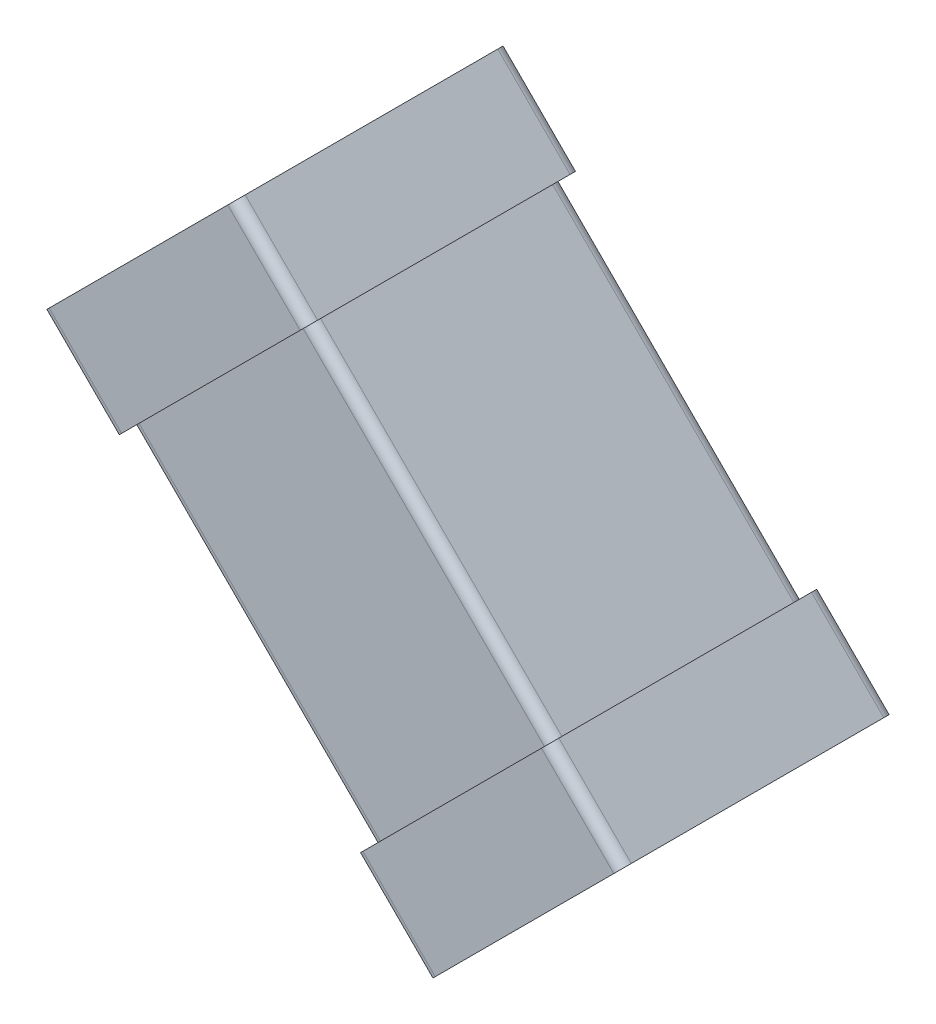
ISO-10303-21;
HEADER;
FILE_DESCRIPTION(('STEP AP214'),'2;1');
FILE_NAME('part.step','',(''),(''),'','','');
FILE_SCHEMA(('AUTOMOTIVE_DESIGN { 1 0 10303 214 1 1 1 1 }'));
ENDSEC;
DATA;
#1=APPLICATION_CONTEXT('core data for automotive mechanical design processes');
#2=APPLICATION_PROTOCOL_DEFINITION('international standard','automotive_design',2000,#1);
#3=PRODUCT_CONTEXT('',#1,'mechanical');
#4=PRODUCT('Part','Part','',(#3));
#5=PRODUCT_RELATED_PRODUCT_CATEGORY('part','',(#4));
#6=PRODUCT_DEFINITION_FORMATION('','',#4);
#7=PRODUCT_DEFINITION_CONTEXT('part definition',#1,'design');
#8=PRODUCT_DEFINITION('design','',#6,#7);
#9=PRODUCT_DEFINITION_SHAPE('','',#8);
#10=(LENGTH_UNIT() NAMED_UNIT(*) SI_UNIT(.MILLI.,.METRE.));
#11=(NAMED_UNIT(*) PLANE_ANGLE_UNIT() SI_UNIT($,.RADIAN.));
#12=(NAMED_UNIT(*) SI_UNIT($,.STERADIAN.) SOLID_ANGLE_UNIT());
#13=UNCERTAINTY_MEASURE_WITH_UNIT(LENGTH_MEASURE(1.E-05),#10,'distance_accuracy_value','');
#14=(GEOMETRIC_REPRESENTATION_CONTEXT(3) GLOBAL_UNCERTAINTY_ASSIGNED_CONTEXT((#13)) GLOBAL_UNIT_ASSIGNED_CONTEXT((#10,
#11,#12)) REPRESENTATION_CONTEXT('',''));
#15=CARTESIAN_POINT('',(0.,0.,0.));
#16=DIRECTION('',(0.,0.,1.));
#17=DIRECTION('',(1.,0.,0.));
#18=AXIS2_PLACEMENT_3D('',#15,#16,#17);
#19=CARTESIAN_POINT('',(174.984206992412,104.541135154926,112.211582908599));
#20=DIRECTION('',(0.707106781186548,-0.707106781186547,0.));
#21=DIRECTION('',(0.,0.,-1.));
#22=AXIS2_PLACEMENT_3D('',#19,#20,#21);
#23=PLANE('',#22);
#24=DIRECTION('',(0.,0.,1.));
#25=VECTOR('',#24,1.);
#26=CARTESIAN_POINT('',(174.984206992412,104.541135154926,112.211582908599));
#27=LINE('',#26,#25);
#28=CARTESIAN_POINT('',(174.984206992412,104.541135154926,112.241582908599));
#29=VERTEX_POINT('',#28);
#30=CARTESIAN_POINT('',(174.984206992412,104.541135154926,112.981582908599));
#31=VERTEX_POINT('',#30);
#32=EDGE_CURVE('E67',#29,#31,#27,.T.);
#33=ORIENTED_EDGE('',*,*,#32,.F.);
#34=CARTESIAN_POINT('',(175.005420195848,104.562348358362,112.241582908599));
#35=DIRECTION('',(0.707106781186548,-0.707106781186547,0.));
#36=DIRECTION('',(0.,0.,1.));
#37=AXIS2_PLACEMENT_3D('',#34,#35,#36);
#38=CIRCLE('',#37,0.0300000000000023);
#39=CARTESIAN_POINT('',(175.005420195848,104.562348358362,112.211582908599));
#40=VERTEX_POINT('',#39);
#41=EDGE_CURVE('E11',#29,#40,#38,.T.);
#42=ORIENTED_EDGE('',*,*,#41,.T.);
#43=DIRECTION('',(0.707106781186547,0.707106781186548,0.));
#44=VECTOR('',#43,1.);
#45=CARTESIAN_POINT('',(174.984206992412,104.541135154926,112.211582908599));
#46=LINE('',#45,#44);
#47=CARTESIAN_POINT('',(175.528679213926,105.08560737644,112.211582908599));
#48=VERTEX_POINT('',#47);
#49=EDGE_CURVE('E55',#40,#48,#46,.T.);
#50=ORIENTED_EDGE('',*,*,#49,.T.);
#51=CARTESIAN_POINT('',(175.528679213926,105.08560737644,112.241582908599));
#52=DIRECTION('',(-0.707106781186548,0.707106781186547,0.));
#53=DIRECTION('',(0.,0.,1.));
#54=AXIS2_PLACEMENT_3D('',#51,#52,#53);
#55=CIRCLE('',#54,0.0300000000000023);
#56=CARTESIAN_POINT('',(175.549892417362,105.106820579876,112.241582908599));
#57=VERTEX_POINT('',#56);
#58=EDGE_CURVE('E294',#57,#48,#55,.T.);
#59=ORIENTED_EDGE('',*,*,#58,.F.);
#60=DIRECTION('',(0.,0.,1.));
#61=VECTOR('',#60,1.);
#62=CARTESIAN_POINT('',(175.549892417362,105.106820579876,112.211582908599));
#63=LINE('',#62,#61);
#64=CARTESIAN_POINT('',(175.549892417362,105.106820579876,112.981582908599));
#65=VERTEX_POINT('',#64);
#66=EDGE_CURVE('E289',#57,#65,#63,.T.);
#67=ORIENTED_EDGE('',*,*,#66,.T.);
#68=CARTESIAN_POINT('',(175.528679213926,105.08560737644,112.981582908599));
#69=DIRECTION('',(0.707106781186548,-0.707106781186547,0.));
#70=DIRECTION('',(0.,0.,1.));
#71=AXIS2_PLACEMENT_3D('',#68,#69,#70);
#72=CIRCLE('',#71,0.0300000000000023);
#73=CARTESIAN_POINT('',(175.528679213926,105.08560737644,113.011582908599));
#74=VERTEX_POINT('',#73);
#75=EDGE_CURVE('E325',#65,#74,#72,.T.);
#76=ORIENTED_EDGE('',*,*,#75,.T.);
#77=DIRECTION('',(0.707106781186547,0.707106781186548,0.));
#78=VECTOR('',#77,1.);
#79=CARTESIAN_POINT('',(174.984206992412,104.541135154926,113.011582908599));
#80=LINE('',#79,#78);
#81=CARTESIAN_POINT('',(175.005420195848,104.562348358362,113.011582908599));
#82=VERTEX_POINT('',#81);
#83=EDGE_CURVE('E298',#82,#74,#80,.T.);
#84=ORIENTED_EDGE('',*,*,#83,.F.);
#85=CARTESIAN_POINT('',(175.005420195848,104.562348358362,112.981582908599));
#86=DIRECTION('',(-0.707106781186548,0.707106781186547,0.));
#87=DIRECTION('',(0.,0.,1.));
#88=AXIS2_PLACEMENT_3D('',#85,#86,#87);
#89=CIRCLE('',#88,0.0300000000000023);
#90=EDGE_CURVE('E343',#31,#82,#89,.T.);
#91=ORIENTED_EDGE('',*,*,#90,.F.);
#92=EDGE_LOOP('',(#33,#42,#50,#59,#67,#76,#84,#91));
#93=FACE_BOUND('',#92,.T.);
#94=ADVANCED_FACE('F44',(#93),#23,.T.);
#95=CARTESIAN_POINT('',(175.337760383006,105.318952614231,112.211582908599));
#96=DIRECTION('',(0.707106781186547,0.707106781186548,0.));
#97=DIRECTION('',(0.,0.,-1.));
#98=AXIS2_PLACEMENT_3D('',#95,#96,#97);
#99=PLANE('',#98);
#100=ORIENTED_EDGE('',*,*,#66,.F.);
#101=DIRECTION('',(0.707106781186548,-0.707106781186547,0.));
#102=VECTOR('',#101,1.);
#103=CARTESIAN_POINT('',(175.337760383006,105.318952614231,112.241582908599));
#104=LINE('',#103,#102);
#105=CARTESIAN_POINT('',(175.337760383006,105.318952614231,112.241582908599));
#106=VERTEX_POINT('',#105);
#107=EDGE_CURVE('E290',#106,#57,#104,.T.);
#108=ORIENTED_EDGE('',*,*,#107,.F.);
#109=DIRECTION('',(0.,0.,1.));
#110=VECTOR('',#109,1.);
#111=CARTESIAN_POINT('',(175.337760383006,105.318952614231,112.211582908599));
#112=LINE('',#111,#110);
#113=CARTESIAN_POINT('',(175.337760383006,105.318952614231,112.981582908599));
#114=VERTEX_POINT('',#113);
#115=EDGE_CURVE('E323',#106,#114,#112,.T.);
#116=ORIENTED_EDGE('',*,*,#115,.T.);
#117=DIRECTION('',(0.707106781186548,-0.707106781186547,0.));
#118=VECTOR('',#117,1.);
#119=CARTESIAN_POINT('',(175.337760383006,105.318952614231,112.981582908599));
#120=LINE('',#119,#118);
#121=EDGE_CURVE('E320',#114,#65,#120,.T.);
#122=ORIENTED_EDGE('',*,*,#121,.T.);
#123=EDGE_LOOP('',(#100,#108,#116,#122));
#124=FACE_BOUND('',#123,.T.);
#125=ADVANCED_FACE('F537',(#124),#99,.T.);
#126=CARTESIAN_POINT('',(175.31654717957,105.297739410796,112.981582908599));
#127=DIRECTION('',(0.707106781186548,-0.707106781186548,0.));
#128=DIRECTION('',(0.707106781186548,0.707106781186548,0.));
#129=AXIS2_PLACEMENT_3D('',#126,#127,#128);
#130=CYLINDRICAL_SURFACE('',#129,0.0299999999999963);
#131=CARTESIAN_POINT('',(175.31654717957,105.297739410796,112.981582908599));
#132=DIRECTION('',(0.707106781186548,-0.707106781186547,0.));
#133=DIRECTION('',(0.,0.,1.));
#134=AXIS2_PLACEMENT_3D('',#131,#132,#133);
#135=CIRCLE('',#134,0.0300000000000023);
#136=CARTESIAN_POINT('',(175.31654717957,105.297739410796,113.011582908599));
#137=VERTEX_POINT('',#136);
#138=EDGE_CURVE('E324',#114,#137,#135,.T.);
#139=ORIENTED_EDGE('',*,*,#138,.T.);
#140=DIRECTION('',(0.707106781186548,-0.707106781186547,0.));
#141=VECTOR('',#140,1.);
#142=CARTESIAN_POINT('',(175.31654717957,105.297739410796,113.011582908599));
#143=LINE('',#142,#141);
#144=EDGE_CURVE('E293',#137,#74,#143,.T.);
#145=ORIENTED_EDGE('',*,*,#144,.T.);
#146=ORIENTED_EDGE('',*,*,#75,.F.);
#147=ORIENTED_EDGE('',*,*,#121,.F.);
#148=EDGE_LOOP('',(#139,#145,#146,#147));
#149=FACE_BOUND('',#148,.T.);
#150=ADVANCED_FACE('F542',(#149),#130,.T.);
#151=CARTESIAN_POINT('',(175.31654717957,105.297739410796,112.241582908599));
#152=DIRECTION('',(0.707106781186548,-0.707106781186548,0.));
#153=DIRECTION('',(0.707106781186548,0.707106781186548,0.));
#154=AXIS2_PLACEMENT_3D('',#151,#152,#153);
#155=CYLINDRICAL_SURFACE('',#154,0.0299999999999963);
#156=ORIENTED_EDGE('',*,*,#107,.T.);
#157=ORIENTED_EDGE('',*,*,#58,.T.);
#158=DIRECTION('',(0.707106781186548,-0.707106781186547,0.));
#159=VECTOR('',#158,1.);
#160=CARTESIAN_POINT('',(175.31654717957,105.297739410796,112.211582908599));
#161=LINE('',#160,#159);
#162=CARTESIAN_POINT('',(175.31654717957,105.297739410796,112.211582908599));
#163=VERTEX_POINT('',#162);
#164=EDGE_CURVE('E306',#163,#48,#161,.T.);
#165=ORIENTED_EDGE('',*,*,#164,.F.);
#166=CARTESIAN_POINT('',(175.31654717957,105.297739410796,112.241582908599));
#167=DIRECTION('',(-0.707106781186548,0.707106781186547,0.));
#168=DIRECTION('',(0.,0.,1.));
#169=AXIS2_PLACEMENT_3D('',#166,#167,#168);
#170=CIRCLE('',#169,0.0300000000000023);
#171=EDGE_CURVE('E48',#106,#163,#170,.T.);
#172=ORIENTED_EDGE('',*,*,#171,.F.);
#173=EDGE_LOOP('',(#156,#157,#165,#172));
#174=FACE_BOUND('',#173,.T.);
#175=ADVANCED_FACE('F566',(#174),#155,.T.);
#176=CARTESIAN_POINT('',(174.772074958056,104.753267189282,113.011582908599));
#177=DIRECTION('',(0.,0.,1.));
#178=DIRECTION('',(1.,0.,0.));
#179=AXIS2_PLACEMENT_3D('',#176,#177,#178);
#180=PLANE('',#179);
#181=DIRECTION('',(0.707106781186547,0.707106781186548,0.));
#182=VECTOR('',#181,1.);
#183=CARTESIAN_POINT('',(174.772074958056,104.753267189282,113.011582908599));
#184=LINE('',#183,#182);
#185=CARTESIAN_POINT('',(174.793288161492,104.774480392718,113.011582908599));
#186=VERTEX_POINT('',#185);
#187=EDGE_CURVE('E478',#186,#137,#184,.T.);
#188=ORIENTED_EDGE('',*,*,#187,.F.);
#189=DIRECTION('',(0.707106781186548,-0.707106781186547,0.));
#190=VECTOR('',#189,1.);
#191=CARTESIAN_POINT('',(174.793288161492,104.774480392718,113.011582908599));
#192=LINE('',#191,#190);
#193=EDGE_CURVE('E295',#186,#82,#192,.T.);
#194=ORIENTED_EDGE('',*,*,#193,.T.);
#195=ORIENTED_EDGE('',*,*,#83,.T.);
#196=ORIENTED_EDGE('',*,*,#144,.F.);
#197=EDGE_LOOP('',(#188,#194,#195,#196));
#198=FACE_BOUND('',#197,.T.);
#199=ADVANCED_FACE('F569',(#198),#180,.T.);
#200=CARTESIAN_POINT('',(174.772074958056,104.753267189282,112.211582908599));
#201=DIRECTION('',(0.,0.,1.));
#202=DIRECTION('',(1.,0.,0.));
#203=AXIS2_PLACEMENT_3D('',#200,#201,#202);
#204=PLANE('',#203);
#205=ORIENTED_EDGE('',*,*,#164,.T.);
#206=ORIENTED_EDGE('',*,*,#49,.F.);
#207=DIRECTION('',(0.707106781186548,-0.707106781186547,0.));
#208=VECTOR('',#207,1.);
#209=CARTESIAN_POINT('',(174.793288161492,104.774480392718,112.211582908599));
#210=LINE('',#209,#208);
#211=CARTESIAN_POINT('',(174.793288161492,104.774480392718,112.211582908599));
#212=VERTEX_POINT('',#211);
#213=EDGE_CURVE('E344',#212,#40,#210,.T.);
#214=ORIENTED_EDGE('',*,*,#213,.F.);
#215=DIRECTION('',(0.707106781186547,0.707106781186548,0.));
#216=VECTOR('',#215,1.);
#217=CARTESIAN_POINT('',(174.772074958056,104.753267189282,112.211582908599));
#218=LINE('',#217,#216);
#219=EDGE_CURVE('E315',#212,#163,#218,.T.);
#220=ORIENTED_EDGE('',*,*,#219,.T.);
#221=EDGE_LOOP('',(#205,#206,#214,#220));
#222=FACE_BOUND('',#221,.T.);
#223=ADVANCED_FACE('F46',(#222),#204,.F.);
#224=CARTESIAN_POINT('',(174.793288161492,104.774480392718,112.981582908599));
#225=DIRECTION('',(0.707106781186548,-0.707106781186548,0.));
#226=DIRECTION('',(-0.707106781186548,-0.707106781186548,0.));
#227=AXIS2_PLACEMENT_3D('',#224,#225,#226);
#228=CYLINDRICAL_SURFACE('',#227,0.0299999999999963);
#229=DIRECTION('',(0.707106781186548,-0.707106781186547,0.));
#230=VECTOR('',#229,1.);
#231=CARTESIAN_POINT('',(174.772074958056,104.753267189282,112.981582908599));
#232=LINE('',#231,#230);
#233=CARTESIAN_POINT('',(174.772074958056,104.753267189282,112.981582908599));
#234=VERTEX_POINT('',#233);
#235=EDGE_CURVE('E389',#234,#31,#232,.T.);
#236=ORIENTED_EDGE('',*,*,#235,.T.);
#237=ORIENTED_EDGE('',*,*,#90,.T.);
#238=ORIENTED_EDGE('',*,*,#193,.F.);
#239=CARTESIAN_POINT('',(174.793288161492,104.774480392718,112.981582908599));
#240=DIRECTION('',(-0.707106781186548,0.707106781186547,0.));
#241=DIRECTION('',(0.,0.,1.));
#242=AXIS2_PLACEMENT_3D('',#239,#240,#241);
#243=CIRCLE('',#242,0.0300000000000023);
#244=EDGE_CURVE('E477',#234,#186,#243,.T.);
#245=ORIENTED_EDGE('',*,*,#244,.F.);
#246=EDGE_LOOP('',(#236,#237,#238,#245));
#247=FACE_BOUND('',#246,.T.);
#248=ADVANCED_FACE('F558',(#247),#228,.T.);
#249=CARTESIAN_POINT('',(174.793288161492,104.774480392718,112.241582908599));
#250=DIRECTION('',(0.707106781186548,-0.707106781186548,0.));
#251=DIRECTION('',(-0.707106781186548,-0.707106781186548,0.));
#252=AXIS2_PLACEMENT_3D('',#249,#250,#251);
#253=CYLINDRICAL_SURFACE('',#252,0.0299999999999963);
#254=CARTESIAN_POINT('',(174.793288161492,104.774480392718,112.241582908599));
#255=DIRECTION('',(0.707106781186548,-0.707106781186547,0.));
#256=DIRECTION('',(0.,0.,1.));
#257=AXIS2_PLACEMENT_3D('',#254,#255,#256);
#258=CIRCLE('',#257,0.0300000000000023);
#259=CARTESIAN_POINT('',(174.772074958056,104.753267189282,112.241582908599));
#260=VERTEX_POINT('',#259);
#261=EDGE_CURVE('E339',#260,#212,#258,.T.);
#262=ORIENTED_EDGE('',*,*,#261,.T.);
#263=ORIENTED_EDGE('',*,*,#213,.T.);
#264=ORIENTED_EDGE('',*,*,#41,.F.);
#265=DIRECTION('',(0.707106781186548,-0.707106781186547,0.));
#266=VECTOR('',#265,1.);
#267=CARTESIAN_POINT('',(174.772074958056,104.753267189282,112.241582908599));
#268=LINE('',#267,#266);
#269=EDGE_CURVE('E444',#260,#29,#268,.T.);
#270=ORIENTED_EDGE('',*,*,#269,.F.);
#271=EDGE_LOOP('',(#262,#263,#264,#270));
#272=FACE_BOUND('',#271,.T.);
#273=ADVANCED_FACE('F547',(#272),#253,.T.);
#274=CARTESIAN_POINT('',(174.772074958056,104.753267189282,112.211582908599));
#275=DIRECTION('',(0.707106781186547,0.707106781186548,0.));
#276=DIRECTION('',(0.,0.,-1.));
#277=AXIS2_PLACEMENT_3D('',#274,#275,#276);
#278=PLANE('',#277);
#279=ORIENTED_EDGE('',*,*,#235,.F.);
#280=DIRECTION('',(0.,0.,1.));
#281=VECTOR('',#280,1.);
#282=CARTESIAN_POINT('',(174.772074958056,104.753267189282,112.211582908599));
#283=LINE('',#282,#281);
#284=EDGE_CURVE('E284',#260,#234,#283,.T.);
#285=ORIENTED_EDGE('',*,*,#284,.F.);
#286=ORIENTED_EDGE('',*,*,#269,.T.);
#287=ORIENTED_EDGE('',*,*,#32,.T.);
#288=EDGE_LOOP('',(#279,#285,#286,#287));
#289=FACE_BOUND('',#288,.T.);
#290=ADVANCED_FACE('F554',(#289),#278,.F.);
#291=CARTESIAN_POINT('',(174.772074958056,104.753267189282,112.211582908599));
#292=DIRECTION('',(0.707106781186548,-0.707106781186547,0.));
#293=DIRECTION('',(0.,0.,-1.));
#294=AXIS2_PLACEMENT_3D('',#291,#292,#293);
#295=PLANE('',#294);
#296=ORIENTED_EDGE('',*,*,#244,.T.);
#297=ORIENTED_EDGE('',*,*,#187,.T.);
#298=ORIENTED_EDGE('',*,*,#138,.F.);
#299=ORIENTED_EDGE('',*,*,#115,.F.);
#300=ORIENTED_EDGE('',*,*,#171,.T.);
#301=ORIENTED_EDGE('',*,*,#219,.F.);
#302=ORIENTED_EDGE('',*,*,#261,.F.);
#303=ORIENTED_EDGE('',*,*,#284,.T.);
#304=EDGE_LOOP('',(#296,#297,#298,#299,#300,#301,#302,#303));
#305=FACE_BOUND('',#304,.T.);
#306=DIRECTION('',(0.707106781186547,0.707106781186548,0.));
#307=VECTOR('',#306,1.);
#308=CARTESIAN_POINT('',(174.793288161492,104.774480392718,112.241582908599));
#309=LINE('',#308,#307);
#310=CARTESIAN_POINT('',(174.814501364928,104.795693596153,112.241582908599));
#311=VERTEX_POINT('',#310);
#312=CARTESIAN_POINT('',(175.295333976134,105.27652620736,112.241582908599));
#313=VERTEX_POINT('',#312);
#314=EDGE_CURVE('E281',#311,#313,#309,.T.);
#315=ORIENTED_EDGE('',*,*,#314,.T.);
#316=CARTESIAN_POINT('',(175.295333976134,105.27652620736,112.271582908599));
#317=DIRECTION('',(-0.707106781186548,0.707106781186547,0.));
#318=DIRECTION('',(0.,0.,1.));
#319=AXIS2_PLACEMENT_3D('',#316,#317,#318);
#320=CIRCLE('',#319,0.0300000000000023);
#321=CARTESIAN_POINT('',(175.31654717957,105.297739410796,112.271582908599));
#322=VERTEX_POINT('',#321);
#323=EDGE_CURVE('E337',#322,#313,#320,.T.);
#324=ORIENTED_EDGE('',*,*,#323,.F.);
#325=DIRECTION('',(0.,0.,1.));
#326=VECTOR('',#325,1.);
#327=CARTESIAN_POINT('',(175.31654717957,105.297739410796,112.241582908599));
#328=LINE('',#327,#326);
#329=CARTESIAN_POINT('',(175.31654717957,105.297739410796,112.951582908599));
#330=VERTEX_POINT('',#329);
#331=EDGE_CURVE('E285',#322,#330,#328,.T.);
#332=ORIENTED_EDGE('',*,*,#331,.T.);
#333=CARTESIAN_POINT('',(175.295333976134,105.27652620736,112.951582908599));
#334=DIRECTION('',(0.707106781186548,-0.707106781186547,0.));
#335=DIRECTION('',(0.,0.,1.));
#336=AXIS2_PLACEMENT_3D('',#333,#334,#335);
#337=CIRCLE('',#336,0.0300000000000023);
#338=CARTESIAN_POINT('',(175.295333976134,105.27652620736,112.981582908599));
#339=VERTEX_POINT('',#338);
#340=EDGE_CURVE('E402',#330,#339,#337,.T.);
#341=ORIENTED_EDGE('',*,*,#340,.T.);
#342=DIRECTION('',(0.707106781186547,0.707106781186548,0.));
#343=VECTOR('',#342,1.);
#344=CARTESIAN_POINT('',(174.793288161492,104.774480392718,112.981582908599));
#345=LINE('',#344,#343);
#346=CARTESIAN_POINT('',(174.814501364928,104.795693596153,112.981582908599));
#347=VERTEX_POINT('',#346);
#348=EDGE_CURVE('E260',#347,#339,#345,.T.);
#349=ORIENTED_EDGE('',*,*,#348,.F.);
#350=CARTESIAN_POINT('',(174.814501364928,104.795693596153,112.951582908599));
#351=DIRECTION('',(-0.707106781186548,0.707106781186547,0.));
#352=DIRECTION('',(0.,0.,1.));
#353=AXIS2_PLACEMENT_3D('',#350,#351,#352);
#354=CIRCLE('',#353,0.0300000000000023);
#355=CARTESIAN_POINT('',(174.793288161492,104.774480392718,112.951582908599));
#356=VERTEX_POINT('',#355);
#357=EDGE_CURVE('E431',#356,#347,#354,.T.);
#358=ORIENTED_EDGE('',*,*,#357,.F.);
#359=DIRECTION('',(0.,0.,1.));
#360=VECTOR('',#359,1.);
#361=CARTESIAN_POINT('',(174.793288161492,104.774480392718,112.241582908599));
#362=LINE('',#361,#360);
#363=CARTESIAN_POINT('',(174.793288161492,104.774480392718,112.271582908599));
#364=VERTEX_POINT('',#363);
#365=EDGE_CURVE('E333',#364,#356,#362,.T.);
#366=ORIENTED_EDGE('',*,*,#365,.F.);
#367=CARTESIAN_POINT('',(174.814501364928,104.795693596153,112.271582908599));
#368=DIRECTION('',(0.707106781186548,-0.707106781186547,0.));
#369=DIRECTION('',(0.,0.,1.));
#370=AXIS2_PLACEMENT_3D('',#367,#368,#369);
#371=CIRCLE('',#370,0.0300000000000023);
#372=EDGE_CURVE('E332',#364,#311,#371,.T.);
#373=ORIENTED_EDGE('',*,*,#372,.T.);
#374=EDGE_LOOP('',(#315,#324,#332,#341,#349,#358,#366,#373));
#375=FACE_BOUND('',#374,.T.);
#376=ADVANCED_FACE('F519',(#305,#375),#295,.F.);
#377=CARTESIAN_POINT('',(174.086181380306,105.481587173904,112.241582908599));
#378=DIRECTION('',(0.707106781186547,0.707106781186548,0.));
#379=DIRECTION('',(0.,0.,-1.));
#380=AXIS2_PLACEMENT_3D('',#377,#378,#379);
#381=PLANE('',#380);
#382=DIRECTION('',(0.707106781186548,-0.707106781186547,0.));
#383=VECTOR('',#382,1.);
#384=CARTESIAN_POINT('',(174.086181380306,105.481587173904,112.951582908599));
#385=LINE('',#384,#383);
#386=CARTESIAN_POINT('',(174.086181380306,105.481587173904,112.951582908599));
#387=VERTEX_POINT('',#386);
#388=EDGE_CURVE('E428',#387,#356,#385,.T.);
#389=ORIENTED_EDGE('',*,*,#388,.F.);
#390=DIRECTION('',(0.,0.,1.));
#391=VECTOR('',#390,1.);
#392=CARTESIAN_POINT('',(174.086181380306,105.481587173904,112.241582908599));
#393=LINE('',#392,#391);
#394=CARTESIAN_POINT('',(174.086181380306,105.481587173904,112.271582908599));
#395=VERTEX_POINT('',#394);
#396=EDGE_CURVE('E421',#395,#387,#393,.T.);
#397=ORIENTED_EDGE('',*,*,#396,.F.);
#398=DIRECTION('',(0.707106781186548,-0.707106781186547,0.));
#399=VECTOR('',#398,1.);
#400=CARTESIAN_POINT('',(174.086181380306,105.481587173904,112.271582908599));
#401=LINE('',#400,#399);
#402=EDGE_CURVE('E328',#395,#364,#401,.T.);
#403=ORIENTED_EDGE('',*,*,#402,.T.);
#404=ORIENTED_EDGE('',*,*,#365,.T.);
#405=EDGE_LOOP('',(#389,#397,#403,#404));
#406=FACE_BOUND('',#405,.T.);
#407=ADVANCED_FACE('F523',(#406),#381,.F.);
#408=CARTESIAN_POINT('',(174.107394583742,105.50280037734,112.951582908599));
#409=DIRECTION('',(0.707106781186548,-0.707106781186548,0.));
#410=DIRECTION('',(-0.707106781186548,-0.707106781186548,0.));
#411=AXIS2_PLACEMENT_3D('',#408,#409,#410);
#412=CYLINDRICAL_SURFACE('',#411,0.0299999999999963);
#413=ORIENTED_EDGE('',*,*,#388,.T.);
#414=ORIENTED_EDGE('',*,*,#357,.T.);
#415=DIRECTION('',(0.707106781186548,-0.707106781186547,0.));
#416=VECTOR('',#415,1.);
#417=CARTESIAN_POINT('',(174.107394583742,105.50280037734,112.981582908599));
#418=LINE('',#417,#416);
#419=CARTESIAN_POINT('',(174.107394583742,105.50280037734,112.981582908599));
#420=VERTEX_POINT('',#419);
#421=EDGE_CURVE('E275',#420,#347,#418,.T.);
#422=ORIENTED_EDGE('',*,*,#421,.F.);
#423=CARTESIAN_POINT('',(174.107394583742,105.50280037734,112.951582908599));
#424=DIRECTION('',(-0.707106781186548,0.707106781186547,0.));
#425=DIRECTION('',(0.,0.,1.));
#426=AXIS2_PLACEMENT_3D('',#423,#424,#425);
#427=CIRCLE('',#426,0.0300000000000023);
#428=EDGE_CURVE('E250',#387,#420,#427,.T.);
#429=ORIENTED_EDGE('',*,*,#428,.F.);
#430=EDGE_LOOP('',(#413,#414,#422,#429));
#431=FACE_BOUND('',#430,.T.);
#432=ADVANCED_FACE('F525',(#431),#412,.T.);
#433=CARTESIAN_POINT('',(174.086181380306,105.481587173904,112.981582908599));
#434=DIRECTION('',(0.,0.,1.));
#435=DIRECTION('',(1.,0.,0.));
#436=AXIS2_PLACEMENT_3D('',#433,#434,#435);
#437=PLANE('',#436);
#438=DIRECTION('',(0.707106781186547,0.707106781186548,0.));
#439=VECTOR('',#438,1.);
#440=CARTESIAN_POINT('',(174.086181380306,105.481587173904,112.981582908599));
#441=LINE('',#440,#439);
#442=CARTESIAN_POINT('',(174.588227194948,105.983632988547,112.981582908599));
#443=VERTEX_POINT('',#442);
#444=EDGE_CURVE('E241',#420,#443,#441,.T.);
#445=ORIENTED_EDGE('',*,*,#444,.F.);
#446=ORIENTED_EDGE('',*,*,#421,.T.);
#447=ORIENTED_EDGE('',*,*,#348,.T.);
#448=DIRECTION('',(0.707106781186548,-0.707106781186547,0.));
#449=VECTOR('',#448,1.);
#450=CARTESIAN_POINT('',(174.588227194948,105.983632988547,112.981582908599));
#451=LINE('',#450,#449);
#452=EDGE_CURVE('E258',#443,#339,#451,.T.);
#453=ORIENTED_EDGE('',*,*,#452,.F.);
#454=EDGE_LOOP('',(#445,#446,#447,#453));
#455=FACE_BOUND('',#454,.T.);
#456=ADVANCED_FACE('F259',(#455),#437,.T.);
#457=CARTESIAN_POINT('',(174.588227194948,105.983632988547,112.951582908599));
#458=DIRECTION('',(0.707106781186548,-0.707106781186548,0.));
#459=DIRECTION('',(0.707106781186548,0.707106781186548,0.));
#460=AXIS2_PLACEMENT_3D('',#457,#458,#459);
#461=CYLINDRICAL_SURFACE('',#460,0.0299999999999963);
#462=CARTESIAN_POINT('',(174.588227194948,105.983632988547,112.951582908599));
#463=DIRECTION('',(0.707106781186548,-0.707106781186547,0.));
#464=DIRECTION('',(0.,0.,1.));
#465=AXIS2_PLACEMENT_3D('',#462,#463,#464);
#466=CIRCLE('',#465,0.0300000000000023);
#467=CARTESIAN_POINT('',(174.609440398384,106.004846191982,112.951582908599));
#468=VERTEX_POINT('',#467);
#469=EDGE_CURVE('E247',#468,#443,#466,.T.);
#470=ORIENTED_EDGE('',*,*,#469,.T.);
#471=ORIENTED_EDGE('',*,*,#452,.T.);
#472=ORIENTED_EDGE('',*,*,#340,.F.);
#473=DIRECTION('',(0.707106781186548,-0.707106781186547,0.));
#474=VECTOR('',#473,1.);
#475=CARTESIAN_POINT('',(174.609440398384,106.004846191982,112.951582908599));
#476=LINE('',#475,#474);
#477=EDGE_CURVE('E268',#468,#330,#476,.T.);
#478=ORIENTED_EDGE('',*,*,#477,.F.);
#479=EDGE_LOOP('',(#470,#471,#472,#478));
#480=FACE_BOUND('',#479,.T.);
#481=ADVANCED_FACE('F266',(#480),#461,.T.);
#482=CARTESIAN_POINT('',(174.609440398384,106.004846191982,112.241582908599));
#483=DIRECTION('',(0.707106781186547,0.707106781186548,0.));
#484=DIRECTION('',(0.,0.,-1.));
#485=AXIS2_PLACEMENT_3D('',#482,#483,#484);
#486=PLANE('',#485);
#487=ORIENTED_EDGE('',*,*,#331,.F.);
#488=DIRECTION('',(0.707106781186548,-0.707106781186547,0.));
#489=VECTOR('',#488,1.);
#490=CARTESIAN_POINT('',(174.609440398384,106.004846191982,112.271582908599));
#491=LINE('',#490,#489);
#492=CARTESIAN_POINT('',(174.609440398384,106.004846191982,112.271582908599));
#493=VERTEX_POINT('',#492);
#494=EDGE_CURVE('E334',#493,#322,#491,.T.);
#495=ORIENTED_EDGE('',*,*,#494,.F.);
#496=DIRECTION('',(0.,0.,1.));
#497=VECTOR('',#496,1.);
#498=CARTESIAN_POINT('',(174.609440398384,106.004846191982,112.241582908599));
#499=LINE('',#498,#497);
#500=EDGE_CURVE('E264',#493,#468,#499,.T.);
#501=ORIENTED_EDGE('',*,*,#500,.T.);
#502=ORIENTED_EDGE('',*,*,#477,.T.);
#503=EDGE_LOOP('',(#487,#495,#501,#502));
#504=FACE_BOUND('',#503,.T.);
#505=ADVANCED_FACE('F579',(#504),#486,.T.);
#506=CARTESIAN_POINT('',(174.588227194948,105.983632988547,112.271582908599));
#507=DIRECTION('',(0.707106781186548,-0.707106781186548,0.));
#508=DIRECTION('',(0.707106781186548,0.707106781186548,0.));
#509=AXIS2_PLACEMENT_3D('',#506,#507,#508);
#510=CYLINDRICAL_SURFACE('',#509,0.0299999999999963);
#511=ORIENTED_EDGE('',*,*,#494,.T.);
#512=ORIENTED_EDGE('',*,*,#323,.T.);
#513=DIRECTION('',(0.707106781186548,-0.707106781186547,0.));
#514=VECTOR('',#513,1.);
#515=CARTESIAN_POINT('',(174.588227194948,105.983632988547,112.241582908599));
#516=LINE('',#515,#514);
#517=CARTESIAN_POINT('',(174.588227194948,105.983632988547,112.241582908599));
#518=VERTEX_POINT('',#517);
#519=EDGE_CURVE('E411',#518,#313,#516,.T.);
#520=ORIENTED_EDGE('',*,*,#519,.F.);
#521=CARTESIAN_POINT('',(174.588227194948,105.983632988547,112.271582908599));
#522=DIRECTION('',(-0.707106781186548,0.707106781186547,0.));
#523=DIRECTION('',(0.,0.,1.));
#524=AXIS2_PLACEMENT_3D('',#521,#522,#523);
#525=CIRCLE('',#524,0.0300000000000023);
#526=EDGE_CURVE('E255',#493,#518,#525,.T.);
#527=ORIENTED_EDGE('',*,*,#526,.F.);
#528=EDGE_LOOP('',(#511,#512,#520,#527));
#529=FACE_BOUND('',#528,.T.);
#530=ADVANCED_FACE('F516',(#529),#510,.T.);
#531=CARTESIAN_POINT('',(174.086181380306,105.481587173904,112.241582908599));
#532=DIRECTION('',(0.,0.,1.));
#533=DIRECTION('',(1.,0.,0.));
#534=AXIS2_PLACEMENT_3D('',#531,#532,#533);
#535=PLANE('',#534);
#536=ORIENTED_EDGE('',*,*,#519,.T.);
#537=ORIENTED_EDGE('',*,*,#314,.F.);
#538=DIRECTION('',(0.707106781186548,-0.707106781186547,0.));
#539=VECTOR('',#538,1.);
#540=CARTESIAN_POINT('',(174.107394583742,105.50280037734,112.241582908599));
#541=LINE('',#540,#539);
#542=CARTESIAN_POINT('',(174.107394583742,105.50280037734,112.241582908599));
#543=VERTEX_POINT('',#542);
#544=EDGE_CURVE('E356',#543,#311,#541,.T.);
#545=ORIENTED_EDGE('',*,*,#544,.F.);
#546=DIRECTION('',(0.707106781186547,0.707106781186548,0.));
#547=VECTOR('',#546,1.);
#548=CARTESIAN_POINT('',(174.086181380306,105.481587173904,112.241582908599));
#549=LINE('',#548,#547);
#550=EDGE_CURVE('E435',#543,#518,#549,.T.);
#551=ORIENTED_EDGE('',*,*,#550,.T.);
#552=EDGE_LOOP('',(#536,#537,#545,#551));
#553=FACE_BOUND('',#552,.T.);
#554=ADVANCED_FACE('F512',(#553),#535,.F.);
#555=CARTESIAN_POINT('',(174.107394583742,105.50280037734,112.271582908599));
#556=DIRECTION('',(0.707106781186548,-0.707106781186548,0.));
#557=DIRECTION('',(-0.707106781186548,-0.707106781186548,0.));
#558=AXIS2_PLACEMENT_3D('',#555,#556,#557);
#559=CYLINDRICAL_SURFACE('',#558,0.0299999999999963);
#560=CARTESIAN_POINT('',(174.107394583742,105.50280037734,112.271582908599));
#561=DIRECTION('',(0.707106781186548,-0.707106781186547,0.));
#562=DIRECTION('',(0.,0.,1.));
#563=AXIS2_PLACEMENT_3D('',#560,#561,#562);
#564=CIRCLE('',#563,0.0300000000000023);
#565=EDGE_CURVE('E451',#395,#543,#564,.T.);
#566=ORIENTED_EDGE('',*,*,#565,.T.);
#567=ORIENTED_EDGE('',*,*,#544,.T.);
#568=ORIENTED_EDGE('',*,*,#372,.F.);
#569=ORIENTED_EDGE('',*,*,#402,.F.);
#570=EDGE_LOOP('',(#566,#567,#568,#569));
#571=FACE_BOUND('',#570,.T.);
#572=ADVANCED_FACE('F507',(#571),#559,.T.);
#573=CARTESIAN_POINT('',(174.06496817687,105.460373970469,112.211582908599));
#574=DIRECTION('',(0.707106781186548,-0.707106781186547,0.));
#575=DIRECTION('',(0.,0.,-1.));
#576=AXIS2_PLACEMENT_3D('',#573,#574,#575);
#577=PLANE('',#576);
#578=DIRECTION('',(0.,0.,1.));
#579=VECTOR('',#578,1.);
#580=CARTESIAN_POINT('',(174.06496817687,105.460373970469,112.211582908599));
#581=LINE('',#580,#579);
#582=CARTESIAN_POINT('',(174.06496817687,105.460373970469,112.241582908599));
#583=VERTEX_POINT('',#582);
#584=CARTESIAN_POINT('',(174.06496817687,105.460373970469,112.981582908599));
#585=VERTEX_POINT('',#584);
#586=EDGE_CURVE('E375',#583,#585,#581,.T.);
#587=ORIENTED_EDGE('',*,*,#586,.F.);
#588=CARTESIAN_POINT('',(174.086181380306,105.481587173904,112.241582908599));
#589=DIRECTION('',(0.707106781186548,-0.707106781186547,0.));
#590=DIRECTION('',(0.,0.,1.));
#591=AXIS2_PLACEMENT_3D('',#588,#589,#590);
#592=CIRCLE('',#591,0.0300000000000023);
#593=CARTESIAN_POINT('',(174.086181380306,105.481587173904,112.211582908599));
#594=VERTEX_POINT('',#593);
#595=EDGE_CURVE('E352',#583,#594,#592,.T.);
#596=ORIENTED_EDGE('',*,*,#595,.T.);
#597=DIRECTION('',(0.707106781186547,0.707106781186548,0.));
#598=VECTOR('',#597,1.);
#599=CARTESIAN_POINT('',(174.06496817687,105.460373970469,112.211582908599));
#600=LINE('',#599,#598);
#601=CARTESIAN_POINT('',(174.609440398384,106.004846191982,112.211582908599));
#602=VERTEX_POINT('',#601);
#603=EDGE_CURVE('E357',#594,#602,#600,.T.);
#604=ORIENTED_EDGE('',*,*,#603,.T.);
#605=CARTESIAN_POINT('',(174.609440398384,106.004846191982,112.241582908599));
#606=DIRECTION('',(-0.707106781186548,0.707106781186547,0.));
#607=DIRECTION('',(0.,0.,1.));
#608=AXIS2_PLACEMENT_3D('',#605,#606,#607);
#609=CIRCLE('',#608,0.0300000000000023);
#610=CARTESIAN_POINT('',(174.630653601819,106.026059395418,112.241582908599));
#611=VERTEX_POINT('',#610);
#612=EDGE_CURVE('E368',#611,#602,#609,.T.);
#613=ORIENTED_EDGE('',*,*,#612,.F.);
#614=DIRECTION('',(0.,0.,1.));
#615=VECTOR('',#614,1.);
#616=CARTESIAN_POINT('',(174.630653601819,106.026059395418,112.211582908599));
#617=LINE('',#616,#615);
#618=CARTESIAN_POINT('',(174.630653601819,106.026059395418,112.981582908599));
#619=VERTEX_POINT('',#618);
#620=EDGE_CURVE('E379',#611,#619,#617,.T.);
#621=ORIENTED_EDGE('',*,*,#620,.T.);
#622=CARTESIAN_POINT('',(174.609440398384,106.004846191982,112.981582908599));
#623=DIRECTION('',(0.707106781186548,-0.707106781186547,0.));
#624=DIRECTION('',(0.,0.,1.));
#625=AXIS2_PLACEMENT_3D('',#622,#623,#624);
#626=CIRCLE('',#625,0.0300000000000023);
#627=CARTESIAN_POINT('',(174.609440398384,106.004846191982,113.011582908599));
#628=VERTEX_POINT('',#627);
#629=EDGE_CURVE('E398',#619,#628,#626,.T.);
#630=ORIENTED_EDGE('',*,*,#629,.T.);
#631=DIRECTION('',(0.707106781186547,0.707106781186548,0.));
#632=VECTOR('',#631,1.);
#633=CARTESIAN_POINT('',(174.06496817687,105.460373970469,113.011582908599));
#634=LINE('',#633,#632);
#635=CARTESIAN_POINT('',(174.086181380306,105.481587173904,113.011582908599));
#636=VERTEX_POINT('',#635);
#637=EDGE_CURVE('E369',#636,#628,#634,.T.);
#638=ORIENTED_EDGE('',*,*,#637,.F.);
#639=CARTESIAN_POINT('',(174.086181380306,105.481587173904,112.981582908599));
#640=DIRECTION('',(-0.707106781186548,0.707106781186547,0.));
#641=DIRECTION('',(0.,0.,1.));
#642=AXIS2_PLACEMENT_3D('',#639,#640,#641);
#643=CIRCLE('',#642,0.0300000000000023);
#644=EDGE_CURVE('E385',#585,#636,#643,.T.);
#645=ORIENTED_EDGE('',*,*,#644,.F.);
#646=EDGE_LOOP('',(#587,#596,#604,#613,#621,#630,#638,#645));
#647=FACE_BOUND('',#646,.T.);
#648=ORIENTED_EDGE('',*,*,#565,.F.);
#649=ORIENTED_EDGE('',*,*,#396,.T.);
#650=ORIENTED_EDGE('',*,*,#428,.T.);
#651=ORIENTED_EDGE('',*,*,#444,.T.);
#652=ORIENTED_EDGE('',*,*,#469,.F.);
#653=ORIENTED_EDGE('',*,*,#500,.F.);
#654=ORIENTED_EDGE('',*,*,#526,.T.);
#655=ORIENTED_EDGE('',*,*,#550,.F.);
#656=EDGE_LOOP('',(#648,#649,#650,#651,#652,#653,#654,#655));
#657=FACE_BOUND('',#656,.T.);
#658=ADVANCED_FACE('F244',(#647,#657),#577,.T.);
#659=CARTESIAN_POINT('',(174.418521567464,106.238191429774,112.211582908599));
#660=DIRECTION('',(0.707106781186547,0.707106781186548,0.));
#661=DIRECTION('',(0.,0.,-1.));
#662=AXIS2_PLACEMENT_3D('',#659,#660,#661);
#663=PLANE('',#662);
#664=ORIENTED_EDGE('',*,*,#620,.F.);
#665=DIRECTION('',(0.707106781186548,-0.707106781186547,0.));
#666=VECTOR('',#665,1.);
#667=CARTESIAN_POINT('',(174.418521567464,106.238191429774,112.241582908599));
#668=LINE('',#667,#666);
#669=CARTESIAN_POINT('',(174.418521567464,106.238191429774,112.241582908599));
#670=VERTEX_POINT('',#669);
#671=EDGE_CURVE('E390',#670,#611,#668,.T.);
#672=ORIENTED_EDGE('',*,*,#671,.F.);
#673=DIRECTION('',(0.,0.,1.));
#674=VECTOR('',#673,1.);
#675=CARTESIAN_POINT('',(174.418521567464,106.238191429774,112.211582908599));
#676=LINE('',#675,#674);
#677=CARTESIAN_POINT('',(174.418521567464,106.238191429774,112.981582908599));
#678=VERTEX_POINT('',#677);
#679=EDGE_CURVE('E362',#670,#678,#676,.T.);
#680=ORIENTED_EDGE('',*,*,#679,.T.);
#681=DIRECTION('',(0.707106781186548,-0.707106781186547,0.));
#682=VECTOR('',#681,1.);
#683=CARTESIAN_POINT('',(174.418521567464,106.238191429774,112.981582908599));
#684=LINE('',#683,#682);
#685=EDGE_CURVE('E358',#678,#619,#684,.T.);
#686=ORIENTED_EDGE('',*,*,#685,.T.);
#687=EDGE_LOOP('',(#664,#672,#680,#686));
#688=FACE_BOUND('',#687,.T.);
#689=ADVANCED_FACE('F549',(#688),#663,.T.);
#690=CARTESIAN_POINT('',(174.397308364028,106.216978226338,112.981582908599));
#691=DIRECTION('',(0.707106781186548,-0.707106781186548,0.));
#692=DIRECTION('',(0.707106781186548,0.707106781186548,0.));
#693=AXIS2_PLACEMENT_3D('',#690,#691,#692);
#694=CYLINDRICAL_SURFACE('',#693,0.0299999999999963);
#695=CARTESIAN_POINT('',(174.397308364028,106.216978226338,112.981582908599));
#696=DIRECTION('',(0.707106781186548,-0.707106781186547,0.));
#697=DIRECTION('',(0.,0.,1.));
#698=AXIS2_PLACEMENT_3D('',#695,#696,#697);
#699=CIRCLE('',#698,0.0300000000000023);
#700=CARTESIAN_POINT('',(174.397308364028,106.216978226338,113.011582908599));
#701=VERTEX_POINT('',#700);
#702=EDGE_CURVE('E363',#678,#701,#699,.T.);
#703=ORIENTED_EDGE('',*,*,#702,.T.);
#704=DIRECTION('',(0.707106781186548,-0.707106781186547,0.));
#705=VECTOR('',#704,1.);
#706=CARTESIAN_POINT('',(174.397308364028,106.216978226338,113.011582908599));
#707=LINE('',#706,#705);
#708=EDGE_CURVE('E393',#701,#628,#707,.T.);
#709=ORIENTED_EDGE('',*,*,#708,.T.);
#710=ORIENTED_EDGE('',*,*,#629,.F.);
#711=ORIENTED_EDGE('',*,*,#685,.F.);
#712=EDGE_LOOP('',(#703,#709,#710,#711));
#713=FACE_BOUND('',#712,.T.);
#714=ADVANCED_FACE('F552',(#713),#694,.T.);
#715=CARTESIAN_POINT('',(174.397308364028,106.216978226338,112.241582908599));
#716=DIRECTION('',(0.707106781186548,-0.707106781186548,0.));
#717=DIRECTION('',(0.707106781186548,0.707106781186548,0.));
#718=AXIS2_PLACEMENT_3D('',#715,#716,#717);
#719=CYLINDRICAL_SURFACE('',#718,0.0299999999999963);
#720=ORIENTED_EDGE('',*,*,#671,.T.);
#721=ORIENTED_EDGE('',*,*,#612,.T.);
#722=DIRECTION('',(0.707106781186548,-0.707106781186547,0.));
#723=VECTOR('',#722,1.);
#724=CARTESIAN_POINT('',(174.397308364028,106.216978226338,112.211582908599));
#725=LINE('',#724,#723);
#726=CARTESIAN_POINT('',(174.397308364028,106.216978226338,112.211582908599));
#727=VERTEX_POINT('',#726);
#728=EDGE_CURVE('E462',#727,#602,#725,.T.);
#729=ORIENTED_EDGE('',*,*,#728,.F.);
#730=CARTESIAN_POINT('',(174.397308364028,106.216978226338,112.241582908599));
#731=DIRECTION('',(-0.707106781186548,0.707106781186547,0.));
#732=DIRECTION('',(0.,0.,1.));
#733=AXIS2_PLACEMENT_3D('',#730,#731,#732);
#734=CIRCLE('',#733,0.0300000000000023);
#735=EDGE_CURVE('E349',#670,#727,#734,.T.);
#736=ORIENTED_EDGE('',*,*,#735,.F.);
#737=EDGE_LOOP('',(#720,#721,#729,#736));
#738=FACE_BOUND('',#737,.T.);
#739=ADVANCED_FACE('F564',(#738),#719,.T.);
#740=CARTESIAN_POINT('',(173.852836142514,105.672506004825,113.011582908599));
#741=DIRECTION('',(0.,0.,1.));
#742=DIRECTION('',(1.,0.,0.));
#743=AXIS2_PLACEMENT_3D('',#740,#741,#742);
#744=PLANE('',#743);
#745=DIRECTION('',(0.707106781186547,0.707106781186548,0.));
#746=VECTOR('',#745,1.);
#747=CARTESIAN_POINT('',(173.852836142514,105.672506004825,113.011582908599));
#748=LINE('',#747,#746);
#749=CARTESIAN_POINT('',(173.87404934595,105.69371920826,113.011582908599));
#750=VERTEX_POINT('',#749);
#751=EDGE_CURVE('E345',#750,#701,#748,.T.);
#752=ORIENTED_EDGE('',*,*,#751,.F.);
#753=DIRECTION('',(0.707106781186548,-0.707106781186547,0.));
#754=VECTOR('',#753,1.);
#755=CARTESIAN_POINT('',(173.87404934595,105.69371920826,113.011582908599));
#756=LINE('',#755,#754);
#757=EDGE_CURVE('E364',#750,#636,#756,.T.);
#758=ORIENTED_EDGE('',*,*,#757,.T.);
#759=ORIENTED_EDGE('',*,*,#637,.T.);
#760=ORIENTED_EDGE('',*,*,#708,.F.);
#761=EDGE_LOOP('',(#752,#758,#759,#760));
#762=FACE_BOUND('',#761,.T.);
#763=ADVANCED_FACE('F594',(#762),#744,.T.);
#764=CARTESIAN_POINT('',(173.852836142514,105.672506004825,112.211582908599));
#765=DIRECTION('',(0.,0.,1.));
#766=DIRECTION('',(1.,0.,0.));
#767=AXIS2_PLACEMENT_3D('',#764,#765,#766);
#768=PLANE('',#767);
#769=ORIENTED_EDGE('',*,*,#728,.T.);
#770=ORIENTED_EDGE('',*,*,#603,.F.);
#771=DIRECTION('',(0.707106781186548,-0.707106781186547,0.));
#772=VECTOR('',#771,1.);
#773=CARTESIAN_POINT('',(173.87404934595,105.69371920826,112.211582908599));
#774=LINE('',#773,#772);
#775=CARTESIAN_POINT('',(173.87404934595,105.69371920826,112.211582908599));
#776=VERTEX_POINT('',#775);
#777=EDGE_CURVE('E374',#776,#594,#774,.T.);
#778=ORIENTED_EDGE('',*,*,#777,.F.);
#779=DIRECTION('',(0.707106781186547,0.707106781186548,0.));
#780=VECTOR('',#779,1.);
#781=CARTESIAN_POINT('',(173.852836142514,105.672506004825,112.211582908599));
#782=LINE('',#781,#780);
#783=EDGE_CURVE('E384',#776,#727,#782,.T.);
#784=ORIENTED_EDGE('',*,*,#783,.T.);
#785=EDGE_LOOP('',(#769,#770,#778,#784));
#786=FACE_BOUND('',#785,.T.);
#787=ADVANCED_FACE('F593',(#786),#768,.F.);
#788=CARTESIAN_POINT('',(173.87404934595,105.69371920826,112.981582908599));
#789=DIRECTION('',(0.707106781186548,-0.707106781186548,0.));
#790=DIRECTION('',(-0.707106781186548,-0.707106781186548,0.));
#791=AXIS2_PLACEMENT_3D('',#788,#789,#790);
#792=CYLINDRICAL_SURFACE('',#791,0.0299999999999963);
#793=DIRECTION('',(0.707106781186548,-0.707106781186547,0.));
#794=VECTOR('',#793,1.);
#795=CARTESIAN_POINT('',(173.852836142514,105.672506004825,112.981582908599));
#796=LINE('',#795,#794);
#797=CARTESIAN_POINT('',(173.852836142514,105.672506004825,112.981582908599));
#798=VERTEX_POINT('',#797);
#799=EDGE_CURVE('E380',#798,#585,#796,.T.);
#800=ORIENTED_EDGE('',*,*,#799,.T.);
#801=ORIENTED_EDGE('',*,*,#644,.T.);
#802=ORIENTED_EDGE('',*,*,#757,.F.);
#803=CARTESIAN_POINT('',(173.87404934595,105.69371920826,112.981582908599));
#804=DIRECTION('',(-0.707106781186548,0.707106781186547,0.));
#805=DIRECTION('',(0.,0.,1.));
#806=AXIS2_PLACEMENT_3D('',#803,#804,#805);
#807=CIRCLE('',#806,0.0300000000000023);
#808=EDGE_CURVE('E279',#798,#750,#807,.T.);
#809=ORIENTED_EDGE('',*,*,#808,.F.);
#810=EDGE_LOOP('',(#800,#801,#802,#809));
#811=FACE_BOUND('',#810,.T.);
#812=ADVANCED_FACE('F575',(#811),#792,.T.);
#813=CARTESIAN_POINT('',(173.87404934595,105.69371920826,112.241582908599));
#814=DIRECTION('',(0.707106781186548,-0.707106781186548,0.));
#815=DIRECTION('',(-0.707106781186548,-0.707106781186548,0.));
#816=AXIS2_PLACEMENT_3D('',#813,#814,#815);
#817=CYLINDRICAL_SURFACE('',#816,0.0299999999999963);
#818=CARTESIAN_POINT('',(173.87404934595,105.69371920826,112.241582908599));
#819=DIRECTION('',(0.707106781186548,-0.707106781186547,0.));
#820=DIRECTION('',(0.,0.,1.));
#821=AXIS2_PLACEMENT_3D('',#818,#819,#820);
#822=CIRCLE('',#821,0.0300000000000023);
#823=CARTESIAN_POINT('',(173.852836142514,105.672506004825,112.241582908599));
#824=VERTEX_POINT('',#823);
#825=EDGE_CURVE('E405',#824,#776,#822,.T.);
#826=ORIENTED_EDGE('',*,*,#825,.T.);
#827=ORIENTED_EDGE('',*,*,#777,.T.);
#828=ORIENTED_EDGE('',*,*,#595,.F.);
#829=DIRECTION('',(0.707106781186548,-0.707106781186547,0.));
#830=VECTOR('',#829,1.);
#831=CARTESIAN_POINT('',(173.852836142514,105.672506004825,112.241582908599));
#832=LINE('',#831,#830);
#833=EDGE_CURVE('E370',#824,#583,#832,.T.);
#834=ORIENTED_EDGE('',*,*,#833,.F.);
#835=EDGE_LOOP('',(#826,#827,#828,#834));
#836=FACE_BOUND('',#835,.T.);
#837=ADVANCED_FACE('F571',(#836),#817,.T.);
#838=CARTESIAN_POINT('',(173.852836142514,105.672506004825,112.211582908599));
#839=DIRECTION('',(0.707106781186547,0.707106781186548,0.));
#840=DIRECTION('',(0.,0.,-1.));
#841=AXIS2_PLACEMENT_3D('',#838,#839,#840);
#842=PLANE('',#841);
#843=ORIENTED_EDGE('',*,*,#799,.F.);
#844=DIRECTION('',(0.,0.,1.));
#845=VECTOR('',#844,1.);
#846=CARTESIAN_POINT('',(173.852836142514,105.672506004825,112.211582908599));
#847=LINE('',#846,#845);
#848=EDGE_CURVE('E437',#824,#798,#847,.T.);
#849=ORIENTED_EDGE('',*,*,#848,.F.);
#850=ORIENTED_EDGE('',*,*,#833,.T.);
#851=ORIENTED_EDGE('',*,*,#586,.T.);
#852=EDGE_LOOP('',(#843,#849,#850,#851));
#853=FACE_BOUND('',#852,.T.);
#854=ADVANCED_FACE('F574',(#853),#842,.F.);
#855=CARTESIAN_POINT('',(173.852836142514,105.672506004825,112.211582908599));
#856=DIRECTION('',(0.707106781186548,-0.707106781186547,0.));
#857=DIRECTION('',(0.,0.,-1.));
#858=AXIS2_PLACEMENT_3D('',#855,#856,#857);
#859=PLANE('',#858);
#860=ORIENTED_EDGE('',*,*,#808,.T.);
#861=ORIENTED_EDGE('',*,*,#751,.T.);
#862=ORIENTED_EDGE('',*,*,#702,.F.);
#863=ORIENTED_EDGE('',*,*,#679,.F.);
#864=ORIENTED_EDGE('',*,*,#735,.T.);
#865=ORIENTED_EDGE('',*,*,#783,.F.);
#866=ORIENTED_EDGE('',*,*,#825,.F.);
#867=ORIENTED_EDGE('',*,*,#848,.T.);
#868=EDGE_LOOP('',(#860,#861,#862,#863,#864,#865,#866,#867));
#869=FACE_BOUND('',#868,.T.);
#870=ADVANCED_FACE('F635',(#869),#859,.F.);
#871=CLOSED_SHELL('',(#94,#125,#150,#175,#199,#223,#248,#273,#290,#376,#407,#432,#456,#481,#505,
#530,#554,#572,#658,#689,#714,#739,#763,#787,#812,#837,#854,#870));
#872=MANIFOLD_SOLID_BREP('B2',#871);
#873=ADVANCED_BREP_SHAPE_REPRESENTATION('',(#18,#872),#14);
#874=SHAPE_DEFINITION_REPRESENTATION(#9,#873);
ENDSEC;
END-ISO-10303-21;
